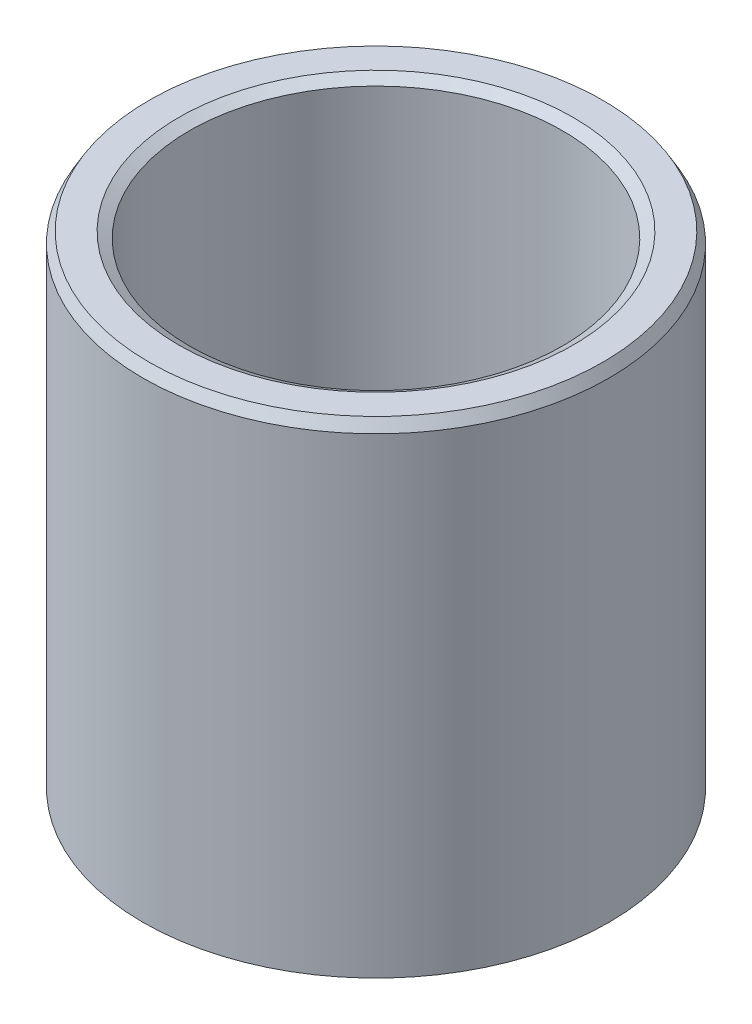
ISO-10303-21;
HEADER;
FILE_DESCRIPTION(('STEP AP214'),'2;1');
FILE_NAME('part.step','',(''),(''),'','','');
FILE_SCHEMA(('AUTOMOTIVE_DESIGN { 1 0 10303 214 1 1 1 1 }'));
ENDSEC;
DATA;
#1=APPLICATION_CONTEXT('core data for automotive mechanical design processes');
#2=APPLICATION_PROTOCOL_DEFINITION('international standard','automotive_design',2000,#1);
#3=PRODUCT_CONTEXT('',#1,'mechanical');
#4=PRODUCT('Part','Part','',(#3));
#5=PRODUCT_RELATED_PRODUCT_CATEGORY('part','',(#4));
#6=PRODUCT_DEFINITION_FORMATION('','',#4);
#7=PRODUCT_DEFINITION_CONTEXT('part definition',#1,'design');
#8=PRODUCT_DEFINITION('design','',#6,#7);
#9=PRODUCT_DEFINITION_SHAPE('','',#8);
#10=(LENGTH_UNIT() NAMED_UNIT(*) SI_UNIT(.MILLI.,.METRE.));
#11=(NAMED_UNIT(*) PLANE_ANGLE_UNIT() SI_UNIT($,.RADIAN.));
#12=(NAMED_UNIT(*) SI_UNIT($,.STERADIAN.) SOLID_ANGLE_UNIT());
#13=UNCERTAINTY_MEASURE_WITH_UNIT(LENGTH_MEASURE(1.E-05),#10,'distance_accuracy_value','');
#14=(GEOMETRIC_REPRESENTATION_CONTEXT(3) GLOBAL_UNCERTAINTY_ASSIGNED_CONTEXT((#13)) GLOBAL_UNIT_ASSIGNED_CONTEXT((#10,
#11,#12)) REPRESENTATION_CONTEXT('',''));
#15=CARTESIAN_POINT('',(0.,0.,0.));
#16=DIRECTION('',(0.,0.,1.));
#17=DIRECTION('',(1.,0.,0.));
#18=AXIS2_PLACEMENT_3D('',#15,#16,#17);
#19=CARTESIAN_POINT('',(0.,125.700634766418,0.));
#20=DIRECTION('',(0.,-1.,0.));
#21=DIRECTION('',(0.,0.,-1.));
#22=AXIS2_PLACEMENT_3D('',#19,#20,#21);
#23=CYLINDRICAL_SURFACE('',#22,60.);
#24=CARTESIAN_POINT('',(0.,1.58856231129165,0.));
#25=DIRECTION('',(0.,1.,0.));
#26=DIRECTION('',(0.,0.,1.));
#27=AXIS2_PLACEMENT_3D('',#24,#25,#26);
#28=CIRCLE('',#27,60.);
#29=CARTESIAN_POINT('',(0.,1.58856231129165,60.));
#30=VERTEX_POINT('',#29);
#31=EDGE_CURVE('E10',#30,#30,#28,.T.);
#32=ORIENTED_EDGE('',*,*,#31,.T.);
#33=EDGE_LOOP('',(#32));
#34=FACE_BOUND('',#33,.T.);
#35=CARTESIAN_POINT('',(0.,122.949164132272,0.));
#36=DIRECTION('',(0.,1.,0.));
#37=DIRECTION('',(0.,0.,1.));
#38=AXIS2_PLACEMENT_3D('',#35,#36,#37);
#39=CIRCLE('',#38,60.);
#40=CARTESIAN_POINT('',(0.,122.949164132272,60.));
#41=VERTEX_POINT('',#40);
#42=EDGE_CURVE('E50',#41,#41,#39,.F.);
#43=ORIENTED_EDGE('',*,*,#42,.T.);
#44=EDGE_LOOP('',(#43));
#45=FACE_BOUND('',#44,.T.);
#46=ADVANCED_FACE('F39',(#34,#45),#23,.T.);
#47=CARTESIAN_POINT('',(0.,125.700634766418,0.));
#48=DIRECTION('',(0.,1.,0.));
#49=DIRECTION('',(0.,0.,1.));
#50=AXIS2_PLACEMENT_3D('',#47,#48,#49);
#51=PLANE('',#50);
#52=CARTESIAN_POINT('',(0.,125.700634766418,0.));
#53=DIRECTION('',(0.,1.,0.));
#54=DIRECTION('',(0.,0.,1.));
#55=AXIS2_PLACEMENT_3D('',#52,#53,#54);
#56=CIRCLE('',#55,50.7795269079363);
#57=CARTESIAN_POINT('',(0.,125.700634766418,50.7795269079363));
#58=VERTEX_POINT('',#57);
#59=EDGE_CURVE('E58',#58,#58,#56,.F.);
#60=ORIENTED_EDGE('',*,*,#59,.T.);
#61=EDGE_LOOP('',(#60));
#62=FACE_BOUND('',#61,.T.);
#63=CARTESIAN_POINT('',(0.,125.700634766418,0.));
#64=DIRECTION('',(0.,1.,0.));
#65=DIRECTION('',(0.,0.,1.));
#66=AXIS2_PLACEMENT_3D('',#63,#64,#65);
#67=CIRCLE('',#66,58.4114376887084);
#68=CARTESIAN_POINT('',(0.,125.700634766418,58.4114376887084));
#69=VERTEX_POINT('',#68);
#70=EDGE_CURVE('E61',#69,#69,#67,.T.);
#71=ORIENTED_EDGE('',*,*,#70,.T.);
#72=EDGE_LOOP('',(#71));
#73=FACE_BOUND('',#72,.T.);
#74=ADVANCED_FACE('F88',(#62,#73),#51,.T.);
#75=CARTESIAN_POINT('',(0.,0.,0.));
#76=DIRECTION('',(0.,1.,0.));
#77=DIRECTION('',(0.,0.,1.));
#78=AXIS2_PLACEMENT_3D('',#75,#76,#77);
#79=PLANE('',#78);
#80=CARTESIAN_POINT('',(0.,0.,0.));
#81=DIRECTION('',(0.,1.,0.));
#82=DIRECTION('',(0.,0.,1.));
#83=AXIS2_PLACEMENT_3D('',#80,#81,#82);
#84=CIRCLE('',#83,49.6166185850818);
#85=CARTESIAN_POINT('',(0.,0.,49.6166185850818));
#86=VERTEX_POINT('',#85);
#87=EDGE_CURVE('E51',#86,#86,#84,.T.);
#88=ORIENTED_EDGE('',*,*,#87,.T.);
#89=EDGE_LOOP('',(#88));
#90=FACE_BOUND('',#89,.T.);
#91=CARTESIAN_POINT('',(0.,0.,0.));
#92=DIRECTION('',(0.,1.,0.));
#93=DIRECTION('',(0.,0.,1.));
#94=AXIS2_PLACEMENT_3D('',#91,#92,#93);
#95=CIRCLE('',#94,57.2485293658538);
#96=CARTESIAN_POINT('',(0.,0.,57.2485293658538));
#97=VERTEX_POINT('',#96);
#98=EDGE_CURVE('E54',#97,#97,#95,.F.);
#99=ORIENTED_EDGE('',*,*,#98,.T.);
#100=EDGE_LOOP('',(#99));
#101=FACE_BOUND('',#100,.T.);
#102=ADVANCED_FACE('F83',(#90,#101),#79,.F.);
#103=CARTESIAN_POINT('',(0.,125.700634766418,0.));
#104=DIRECTION('',(0.,-1.,0.));
#105=DIRECTION('',(0.,0.,-1.));
#106=AXIS2_PLACEMENT_3D('',#103,#104,#105);
#107=CYLINDRICAL_SURFACE('',#106,48.0280562737901);
#108=CARTESIAN_POINT('',(0.,124.112072455126,0.));
#109=DIRECTION('',(0.,1.,0.));
#110=DIRECTION('',(0.,0.,1.));
#111=AXIS2_PLACEMENT_3D('',#108,#109,#110);
#112=CIRCLE('',#111,48.0280562737901);
#113=CARTESIAN_POINT('',(0.,124.112072455126,48.0280562737901));
#114=VERTEX_POINT('',#113);
#115=EDGE_CURVE('E67',#114,#114,#112,.T.);
#116=ORIENTED_EDGE('',*,*,#115,.T.);
#117=EDGE_LOOP('',(#116));
#118=FACE_BOUND('',#117,.T.);
#119=CARTESIAN_POINT('',(0.,2.7514706341462,0.));
#120=DIRECTION('',(0.,1.,0.));
#121=DIRECTION('',(0.,0.,1.));
#122=AXIS2_PLACEMENT_3D('',#119,#120,#121);
#123=CIRCLE('',#122,48.0280562737901);
#124=CARTESIAN_POINT('',(0.,2.7514706341462,48.0280562737901));
#125=VERTEX_POINT('',#124);
#126=EDGE_CURVE('E69',#125,#125,#123,.F.);
#127=ORIENTED_EDGE('',*,*,#126,.T.);
#128=EDGE_LOOP('',(#127));
#129=FACE_BOUND('',#128,.T.);
#130=ADVANCED_FACE('F71',(#118,#129),#107,.F.);
#131=CARTESIAN_POINT('',(0.,124.112072455126,0.));
#132=DIRECTION('',(0.,1.,0.));
#133=DIRECTION('',(0.,0.,1.));
#134=AXIS2_PLACEMENT_3D('',#131,#132,#133);
#135=CONICAL_SURFACE('',#134,48.0280562737901,1.0471975511966);
#136=ORIENTED_EDGE('',*,*,#59,.F.);
#137=EDGE_LOOP('',(#136));
#138=FACE_BOUND('',#137,.T.);
#139=ORIENTED_EDGE('',*,*,#115,.F.);
#140=EDGE_LOOP('',(#139));
#141=FACE_BOUND('',#140,.T.);
#142=ADVANCED_FACE('F77',(#138,#141),#135,.F.);
#143=CARTESIAN_POINT('',(0.,0.,0.));
#144=DIRECTION('',(0.,-1.,0.));
#145=DIRECTION('',(0.,0.,-1.));
#146=AXIS2_PLACEMENT_3D('',#143,#144,#145);
#147=CONICAL_SURFACE('',#146,49.6166185850818,0.523598775598298);
#148=ORIENTED_EDGE('',*,*,#126,.F.);
#149=EDGE_LOOP('',(#148));
#150=FACE_BOUND('',#149,.T.);
#151=ORIENTED_EDGE('',*,*,#87,.F.);
#152=EDGE_LOOP('',(#151));
#153=FACE_BOUND('',#152,.T.);
#154=ADVANCED_FACE('F73',(#150,#153),#147,.F.);
#155=CARTESIAN_POINT('',(0.,1.58856231129165,0.));
#156=DIRECTION('',(0.,1.,0.));
#157=DIRECTION('',(0.,0.,1.));
#158=AXIS2_PLACEMENT_3D('',#155,#156,#157);
#159=CONICAL_SURFACE('',#158,60.,1.0471975511966);
#160=CARTESIAN_POINT('',(0.,0.,57.2485293658538));
#161=CARTESIAN_POINT('',(0.,0.016547524075953,57.2771905182928));
#162=CARTESIAN_POINT('',(0.,0.0330950481519081,57.3058516707318));
#163=CARTESIAN_POINT('',(0.,0.0661900963038184,57.3631739756099));
#164=CARTESIAN_POINT('',(0.,0.0827376203797735,57.3918351280489));
#165=CARTESIAN_POINT('',(0.,0.115832668531683,57.4491574329269));
#166=CARTESIAN_POINT('',(0.,0.132380192607637,57.477818585366));
#167=CARTESIAN_POINT('',(0.,0.165475240759546,57.535140890244));
#168=CARTESIAN_POINT('',(0.,0.182022764835501,57.563802042683));
#169=CARTESIAN_POINT('',(0.,0.21511781298741,57.6211243475611));
#170=CARTESIAN_POINT('',(0.,0.231665337063364,57.6497855000001));
#171=CARTESIAN_POINT('',(0.,0.264760385215274,57.7071078048781));
#172=CARTESIAN_POINT('',(0.,0.281307909291229,57.7357689573172));
#173=CARTESIAN_POINT('',(0.,0.314402957443139,57.7930912621952));
#174=CARTESIAN_POINT('',(0.,0.330950481519093,57.8217524146342));
#175=CARTESIAN_POINT('',(0.,0.364045529671002,57.8790747195123));
#176=CARTESIAN_POINT('',(0.,0.380593053746957,57.9077358719513));
#177=CARTESIAN_POINT('',(0.,0.413688101898866,57.9650581768294));
#178=CARTESIAN_POINT('',(0.,0.43023562597482,57.9937193292684));
#179=CARTESIAN_POINT('',(0.,0.46333067412673,58.0510416341464));
#180=CARTESIAN_POINT('',(0.,0.479878198202685,58.0797027865855));
#181=CARTESIAN_POINT('',(0.,0.512973246354595,58.1370250914635));
#182=CARTESIAN_POINT('',(0.,0.529520770430549,58.1656862439025));
#183=CARTESIAN_POINT('',(0.,0.562615818582458,58.2230085487806));
#184=CARTESIAN_POINT('',(0.,0.579163342658413,58.2516697012196));
#185=CARTESIAN_POINT('',(0.,0.612258390810322,58.3089920060976));
#186=CARTESIAN_POINT('',(0.,0.628805914886276,58.3376531585367));
#187=CARTESIAN_POINT('',(0.,0.661900963038186,58.3949754634147));
#188=CARTESIAN_POINT('',(0.,0.678448487114141,58.4236366158537));
#189=CARTESIAN_POINT('',(0.,0.711543535266051,58.4809589207318));
#190=CARTESIAN_POINT('',(0.,0.728091059342005,58.5096200731708));
#191=CARTESIAN_POINT('',(0.,0.761186107493914,58.5669423780488));
#192=CARTESIAN_POINT('',(0.,0.777733631569869,58.5956035304879));
#193=CARTESIAN_POINT('',(0.,0.810828679721778,58.6529258353659));
#194=CARTESIAN_POINT('',(0.,0.827376203797732,58.6815869878049));
#195=CARTESIAN_POINT('',(0.,0.860471251949642,58.738909292683));
#196=CARTESIAN_POINT('',(0.,0.877018776025597,58.767570445122));
#197=CARTESIAN_POINT('',(0.,0.910113824177507,58.8248927500001));
#198=CARTESIAN_POINT('',(0.,0.926661348253461,58.8535539024391));
#199=CARTESIAN_POINT('',(0.,0.95975639640537,58.9108762073171));
#200=CARTESIAN_POINT('',(0.,0.976303920481325,58.9395373597561));
#201=CARTESIAN_POINT('',(0.,1.00939896863323,58.9968596646342));
#202=CARTESIAN_POINT('',(0.,1.02594649270919,59.0255208170732));
#203=CARTESIAN_POINT('',(0.,1.0590415408611,59.0828431219513));
#204=CARTESIAN_POINT('',(0.,1.07558906493705,59.1115042743903));
#205=CARTESIAN_POINT('',(0.,1.10868411308896,59.1688265792683));
#206=CARTESIAN_POINT('',(0.,1.12523163716492,59.1974877317073));
#207=CARTESIAN_POINT('',(0.,1.15832668531683,59.2548100365854));
#208=CARTESIAN_POINT('',(0.,1.17487420939278,59.2834711890244));
#209=CARTESIAN_POINT('',(0.,1.20796925754469,59.3407934939025));
#210=CARTESIAN_POINT('',(0.,1.22451678162064,59.3694546463415));
#211=CARTESIAN_POINT('',(0.,1.25761182977255,59.4267769512195));
#212=CARTESIAN_POINT('',(0.,1.27415935384851,59.4554381036586));
#213=CARTESIAN_POINT('',(0.,1.30725440200042,59.5127604085366));
#214=CARTESIAN_POINT('',(0.,1.32380192607637,59.5414215609756));
#215=CARTESIAN_POINT('',(0.,1.35689697422828,59.5987438658537));
#216=CARTESIAN_POINT('',(0.,1.37344449830424,59.6274050182927));
#217=CARTESIAN_POINT('',(0.,1.40653954645615,59.6847273231707));
#218=CARTESIAN_POINT('',(0.,1.4230870705321,59.7133884756098));
#219=CARTESIAN_POINT('',(0.,1.45618211868401,59.7707107804878));
#220=CARTESIAN_POINT('',(0.,1.47272964275996,59.7993719329268));
#221=CARTESIAN_POINT('',(0.,1.50582469091187,59.8566942378049));
#222=CARTESIAN_POINT('',(0.,1.52237221498783,59.8853553902439));
#223=CARTESIAN_POINT('',(0.,1.55546726313974,59.942677695122));
#224=CARTESIAN_POINT('',(0.,1.57201478721569,59.971338847561));
#225=CARTESIAN_POINT('',(0.,1.58856231129165,60.));
#226=B_SPLINE_CURVE_WITH_KNOTS('',3,(#160,#161,#162,#163,#164,#165,#166,#167,#168,#169,#170,
#171,#172,#173,#174,#175,#176,#177,#178,#179,#180,#181,#182,#183,#184,#185,#186,#187,#188,#189,
#190,#191,#192,#193,#194,#195,#196,#197,#198,#199,#200,#201,#202,#203,#204,#205,#206,#207,#208,
#209,#210,#211,#212,#213,#214,#215,#216,#217,#218,#219,#220,#221,#222,#223,#224,#225),
.UNSPECIFIED.,.F.,.F.,(4,2,2,2,2,2,2,2,2,2,2,2,2,2,2,2,2,2,2,2,2,2,2,2,2,2,2,2,2,2,2,2,4),(0.,
0.0992851444557304,0.198570288911455,0.297855433367185,0.397140577822915,0.496425722278646,
0.59571086673437,0.694996011190101,0.794281155645831,0.893566300101561,0.992851444557285,
1.09213658901302,1.19142173346875,1.29070687792448,1.3899920223802,1.48927716683593,
1.58856231129166,1.68784745574739,1.78713260020312,1.88641774465885,1.98570288911458,
2.08498803357031,2.18427317802603,2.28355832248176,2.38284346693749,2.48212861139322,
2.58141375584895,2.68069890030468,2.77998404476041,2.87926918921614,2.97855433367186,
3.07783947812759,3.17712462258332),.UNSPECIFIED.);
#227=EDGE_CURVE('BSEAM76',#97,#30,#226,.T.);
#228=ORIENTED_EDGE('',*,*,#98,.F.);
#229=ORIENTED_EDGE('',*,*,#31,.F.);
#230=ORIENTED_EDGE('',*,*,#227,.T.);
#231=ORIENTED_EDGE('',*,*,#227,.F.);
#232=EDGE_LOOP('',(#228,#230,#229,#231));
#233=FACE_BOUND('',#232,.T.);
#234=ADVANCED_FACE('F76',(#233),#159,.T.);
#235=CARTESIAN_POINT('',(0.,125.700634766418,0.));
#236=DIRECTION('',(0.,-1.,0.));
#237=DIRECTION('',(0.,0.,-1.));
#238=AXIS2_PLACEMENT_3D('',#235,#236,#237);
#239=CONICAL_SURFACE('',#238,58.4114376887084,0.523598775598294);
#240=ORIENTED_EDGE('',*,*,#42,.F.);
#241=EDGE_LOOP('',(#240));
#242=FACE_BOUND('',#241,.T.);
#243=ORIENTED_EDGE('',*,*,#70,.F.);
#244=EDGE_LOOP('',(#243));
#245=FACE_BOUND('',#244,.T.);
#246=ADVANCED_FACE('F45',(#242,#245),#239,.T.);
#247=CLOSED_SHELL('',(#46,#74,#102,#130,#142,#154,#234,#246));
#248=MANIFOLD_SOLID_BREP('B2',#247);
#249=ADVANCED_BREP_SHAPE_REPRESENTATION('',(#18,#248),#14);
#250=SHAPE_DEFINITION_REPRESENTATION(#9,#249);
ENDSEC;
END-ISO-10303-21;
